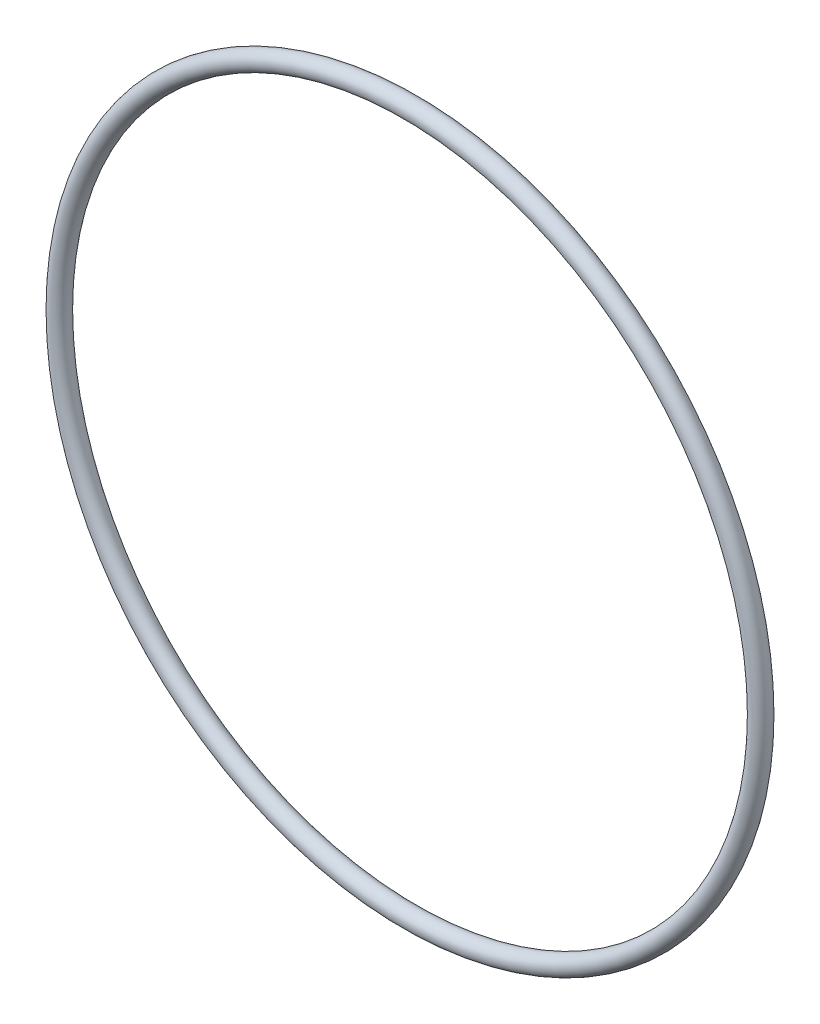
ISO-10303-21;
HEADER;
FILE_DESCRIPTION(('STEP AP214'),'2;1');
FILE_NAME('part.step','',(''),(''),'','','');
FILE_SCHEMA(('AUTOMOTIVE_DESIGN { 1 0 10303 214 1 1 1 1 }'));
ENDSEC;
DATA;
#1=APPLICATION_CONTEXT('core data for automotive mechanical design processes');
#2=APPLICATION_PROTOCOL_DEFINITION('international standard','automotive_design',2000,#1);
#3=PRODUCT_CONTEXT('',#1,'mechanical');
#4=PRODUCT('Part','Part','',(#3));
#5=PRODUCT_RELATED_PRODUCT_CATEGORY('part','',(#4));
#6=PRODUCT_DEFINITION_FORMATION('','',#4);
#7=PRODUCT_DEFINITION_CONTEXT('part definition',#1,'design');
#8=PRODUCT_DEFINITION('design','',#6,#7);
#9=PRODUCT_DEFINITION_SHAPE('','',#8);
#10=(LENGTH_UNIT() NAMED_UNIT(*) SI_UNIT(.MILLI.,.METRE.));
#11=(NAMED_UNIT(*) PLANE_ANGLE_UNIT() SI_UNIT($,.RADIAN.));
#12=(NAMED_UNIT(*) SI_UNIT($,.STERADIAN.) SOLID_ANGLE_UNIT());
#13=UNCERTAINTY_MEASURE_WITH_UNIT(LENGTH_MEASURE(1.E-05),#10,'distance_accuracy_value','');
#14=(GEOMETRIC_REPRESENTATION_CONTEXT(3) GLOBAL_UNCERTAINTY_ASSIGNED_CONTEXT((#13)) GLOBAL_UNIT_ASSIGNED_CONTEXT((#10,
#11,#12)) REPRESENTATION_CONTEXT('',''));
#15=CARTESIAN_POINT('',(0.,0.,0.));
#16=DIRECTION('',(0.,0.,1.));
#17=DIRECTION('',(1.,0.,0.));
#18=AXIS2_PLACEMENT_3D('',#15,#16,#17);
#19=CARTESIAN_POINT('',(0.,0.,0.));
#20=DIRECTION('',(0.,0.,1.));
#21=DIRECTION('',(1.,0.,0.));
#22=AXIS2_PLACEMENT_3D('',#19,#20,#21);
#23=TOROIDAL_SURFACE('',#22,48.768,1.3081);
#24=CARTESIAN_POINT('',(50.0761,0.,0.));
#25=VERTEX_POINT('',#24);
#26=VERTEX_LOOP('',#25);
#27=FACE_BOUND('',#26,.T.);
#28=ADVANCED_FACE('F30',(#27),#23,.T.);
#29=CLOSED_SHELL('',(#28));
#30=MANIFOLD_SOLID_BREP('B2',#29);
#31=ADVANCED_BREP_SHAPE_REPRESENTATION('',(#18,#30),#14);
#32=SHAPE_DEFINITION_REPRESENTATION(#9,#31);
ENDSEC;
END-ISO-10303-21;
